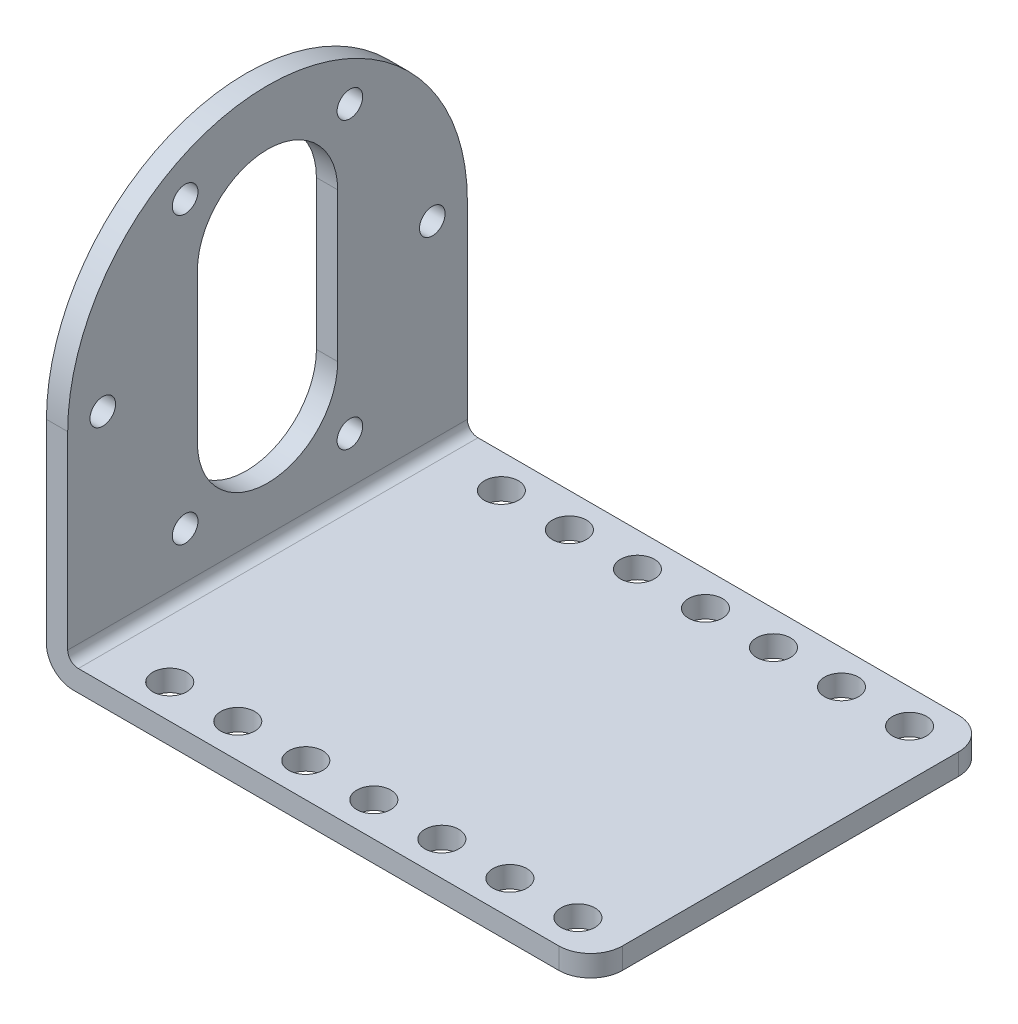
ISO-10303-21;
HEADER;
FILE_DESCRIPTION(('STEP AP214'),'2;1');
FILE_NAME('part.step','',(''),(''),'','','');
FILE_SCHEMA(('AUTOMOTIVE_DESIGN { 1 0 10303 214 1 1 1 1 }'));
ENDSEC;
DATA;
#1=APPLICATION_CONTEXT('core data for automotive mechanical design processes');
#2=APPLICATION_PROTOCOL_DEFINITION('international standard','automotive_design',2000,#1);
#3=PRODUCT_CONTEXT('',#1,'mechanical');
#4=PRODUCT('Part','Part','',(#3));
#5=PRODUCT_RELATED_PRODUCT_CATEGORY('part','',(#4));
#6=PRODUCT_DEFINITION_FORMATION('','',#4);
#7=PRODUCT_DEFINITION_CONTEXT('part definition',#1,'design');
#8=PRODUCT_DEFINITION('design','',#6,#7);
#9=PRODUCT_DEFINITION_SHAPE('','',#8);
#10=(LENGTH_UNIT() NAMED_UNIT(*) SI_UNIT(.MILLI.,.METRE.));
#11=(NAMED_UNIT(*) PLANE_ANGLE_UNIT() SI_UNIT($,.RADIAN.));
#12=(NAMED_UNIT(*) SI_UNIT($,.STERADIAN.) SOLID_ANGLE_UNIT());
#13=UNCERTAINTY_MEASURE_WITH_UNIT(LENGTH_MEASURE(1.E-05),#10,'distance_accuracy_value','');
#14=(GEOMETRIC_REPRESENTATION_CONTEXT(3) GLOBAL_UNCERTAINTY_ASSIGNED_CONTEXT((#13)) GLOBAL_UNIT_ASSIGNED_CONTEXT((#10,
#11,#12)) REPRESENTATION_CONTEXT('',''));
#15=CARTESIAN_POINT('',(0.,0.,0.));
#16=DIRECTION('',(0.,0.,1.));
#17=DIRECTION('',(1.,0.,0.));
#18=AXIS2_PLACEMENT_3D('',#15,#16,#17);
#19=CARTESIAN_POINT('',(3.00000000000001,2.,18.8));
#20=DIRECTION('',(0.,-1.,0.));
#21=DIRECTION('',(0.,0.,-1.));
#22=AXIS2_PLACEMENT_3D('',#19,#20,#21);
#23=PLANE('',#22);
#24=CARTESIAN_POINT('',(21.2,2.,15.6));
#25=DIRECTION('',(0.,1.,0.));
#26=DIRECTION('',(0.,0.,1.));
#27=AXIS2_PLACEMENT_3D('',#24,#25,#26);
#28=CIRCLE('',#27,1.59999999999999);
#29=CARTESIAN_POINT('',(21.2,2.,17.2));
#30=VERTEX_POINT('',#29);
#31=EDGE_CURVE('E345',#30,#30,#28,.T.);
#32=ORIENTED_EDGE('',*,*,#31,.F.);
#33=EDGE_LOOP('',(#32));
#34=FACE_BOUND('',#33,.T.);
#35=CARTESIAN_POINT('',(27.6,2.,15.6));
#36=DIRECTION('',(0.,1.,0.));
#37=DIRECTION('',(0.,0.,1.));
#38=AXIS2_PLACEMENT_3D('',#35,#36,#37);
#39=CIRCLE('',#38,1.59999999999999);
#40=CARTESIAN_POINT('',(27.6,2.,17.2));
#41=VERTEX_POINT('',#40);
#42=EDGE_CURVE('E333',#41,#41,#39,.T.);
#43=ORIENTED_EDGE('',*,*,#42,.F.);
#44=EDGE_LOOP('',(#43));
#45=FACE_BOUND('',#44,.T.);
#46=DIRECTION('',(0.,0.,-1.));
#47=VECTOR('',#46,1.);
#48=CARTESIAN_POINT('',(51.2,2.,18.8));
#49=LINE('',#48,#47);
#50=CARTESIAN_POINT('',(51.2,2.,15.8));
#51=VERTEX_POINT('',#50);
#52=CARTESIAN_POINT('',(51.2,2.,-15.8));
#53=VERTEX_POINT('',#52);
#54=EDGE_CURVE('E180',#51,#53,#49,.T.);
#55=ORIENTED_EDGE('',*,*,#54,.T.);
#56=CARTESIAN_POINT('',(48.2,2.,-15.8));
#57=DIRECTION('',(0.,-1.,0.));
#58=DIRECTION('',(0.,0.,-1.));
#59=AXIS2_PLACEMENT_3D('',#56,#57,#58);
#60=CIRCLE('',#59,3.);
#61=CARTESIAN_POINT('',(48.2,2.,-18.8));
#62=VERTEX_POINT('',#61);
#63=EDGE_CURVE('E196',#53,#62,#60,.F.);
#64=ORIENTED_EDGE('',*,*,#63,.T.);
#65=DIRECTION('',(-1.,0.,0.));
#66=VECTOR('',#65,1.);
#67=CARTESIAN_POINT('',(3.00000000000001,2.,-18.8));
#68=LINE('',#67,#66);
#69=CARTESIAN_POINT('',(3.00000000000001,2.,-18.8));
#70=VERTEX_POINT('',#69);
#71=EDGE_CURVE('E168',#62,#70,#68,.T.);
#72=ORIENTED_EDGE('',*,*,#71,.T.);
#73=DIRECTION('',(0.,0.,-1.));
#74=VECTOR('',#73,1.);
#75=CARTESIAN_POINT('',(3.00000000000001,2.,18.8));
#76=LINE('',#75,#74);
#77=CARTESIAN_POINT('',(3.00000000000001,2.,18.8));
#78=VERTEX_POINT('',#77);
#79=EDGE_CURVE('E177',#78,#70,#76,.T.);
#80=ORIENTED_EDGE('',*,*,#79,.F.);
#81=DIRECTION('',(-1.,0.,0.));
#82=VECTOR('',#81,1.);
#83=CARTESIAN_POINT('',(3.00000000000001,2.,18.8));
#84=LINE('',#83,#82);
#85=CARTESIAN_POINT('',(48.2,2.,18.8));
#86=VERTEX_POINT('',#85);
#87=EDGE_CURVE('E222',#86,#78,#84,.T.);
#88=ORIENTED_EDGE('',*,*,#87,.F.);
#89=CARTESIAN_POINT('',(48.2,2.,15.8));
#90=DIRECTION('',(0.,-1.,0.));
#91=DIRECTION('',(0.,0.,-1.));
#92=AXIS2_PLACEMENT_3D('',#89,#90,#91);
#93=CIRCLE('',#92,3.);
#94=EDGE_CURVE('E194',#86,#51,#93,.F.);
#95=ORIENTED_EDGE('',*,*,#94,.T.);
#96=EDGE_LOOP('',(#55,#64,#72,#80,#88,#95));
#97=FACE_BOUND('',#96,.T.);
#98=CARTESIAN_POINT('',(46.8,2.,15.6));
#99=DIRECTION('',(0.,1.,0.));
#100=DIRECTION('',(0.,0.,1.));
#101=AXIS2_PLACEMENT_3D('',#98,#99,#100);
#102=CIRCLE('',#101,1.59999999999999);
#103=CARTESIAN_POINT('',(46.8,2.,17.2));
#104=VERTEX_POINT('',#103);
#105=EDGE_CURVE('E297',#104,#104,#102,.T.);
#106=ORIENTED_EDGE('',*,*,#105,.F.);
#107=EDGE_LOOP('',(#106));
#108=FACE_BOUND('',#107,.T.);
#109=CARTESIAN_POINT('',(46.8,2.,-15.6));
#110=DIRECTION('',(0.,1.,0.));
#111=DIRECTION('',(0.,0.,1.));
#112=AXIS2_PLACEMENT_3D('',#109,#110,#111);
#113=CIRCLE('',#112,1.59999999999999);
#114=CARTESIAN_POINT('',(46.8,2.,-14.));
#115=VERTEX_POINT('',#114);
#116=EDGE_CURVE('E303',#115,#115,#113,.T.);
#117=ORIENTED_EDGE('',*,*,#116,.F.);
#118=EDGE_LOOP('',(#117));
#119=FACE_BOUND('',#118,.T.);
#120=CARTESIAN_POINT('',(40.4,2.,15.6));
#121=DIRECTION('',(0.,1.,0.));
#122=DIRECTION('',(0.,0.,1.));
#123=AXIS2_PLACEMENT_3D('',#120,#121,#122);
#124=CIRCLE('',#123,1.59999999999999);
#125=CARTESIAN_POINT('',(40.4,2.,17.2));
#126=VERTEX_POINT('',#125);
#127=EDGE_CURVE('E309',#126,#126,#124,.T.);
#128=ORIENTED_EDGE('',*,*,#127,.F.);
#129=EDGE_LOOP('',(#128));
#130=FACE_BOUND('',#129,.T.);
#131=CARTESIAN_POINT('',(40.4,2.,-15.6));
#132=DIRECTION('',(0.,1.,0.));
#133=DIRECTION('',(0.,0.,1.));
#134=AXIS2_PLACEMENT_3D('',#131,#132,#133);
#135=CIRCLE('',#134,1.59999999999999);
#136=CARTESIAN_POINT('',(40.4,2.,-14.));
#137=VERTEX_POINT('',#136);
#138=EDGE_CURVE('E315',#137,#137,#135,.T.);
#139=ORIENTED_EDGE('',*,*,#138,.F.);
#140=EDGE_LOOP('',(#139));
#141=FACE_BOUND('',#140,.T.);
#142=CARTESIAN_POINT('',(34.,2.,15.6));
#143=DIRECTION('',(0.,1.,0.));
#144=DIRECTION('',(0.,0.,1.));
#145=AXIS2_PLACEMENT_3D('',#142,#143,#144);
#146=CIRCLE('',#145,1.59999999999999);
#147=CARTESIAN_POINT('',(34.,2.,17.2));
#148=VERTEX_POINT('',#147);
#149=EDGE_CURVE('E321',#148,#148,#146,.T.);
#150=ORIENTED_EDGE('',*,*,#149,.F.);
#151=EDGE_LOOP('',(#150));
#152=FACE_BOUND('',#151,.T.);
#153=CARTESIAN_POINT('',(34.,2.,-15.6));
#154=DIRECTION('',(0.,1.,0.));
#155=DIRECTION('',(0.,0.,1.));
#156=AXIS2_PLACEMENT_3D('',#153,#154,#155);
#157=CIRCLE('',#156,1.59999999999999);
#158=CARTESIAN_POINT('',(34.,2.,-14.));
#159=VERTEX_POINT('',#158);
#160=EDGE_CURVE('E327',#159,#159,#157,.T.);
#161=ORIENTED_EDGE('',*,*,#160,.F.);
#162=EDGE_LOOP('',(#161));
#163=FACE_BOUND('',#162,.T.);
#164=CARTESIAN_POINT('',(27.6,2.,-15.6));
#165=DIRECTION('',(0.,1.,0.));
#166=DIRECTION('',(0.,0.,1.));
#167=AXIS2_PLACEMENT_3D('',#164,#165,#166);
#168=CIRCLE('',#167,1.59999999999999);
#169=CARTESIAN_POINT('',(27.6,2.,-14.));
#170=VERTEX_POINT('',#169);
#171=EDGE_CURVE('E339',#170,#170,#168,.T.);
#172=ORIENTED_EDGE('',*,*,#171,.F.);
#173=EDGE_LOOP('',(#172));
#174=FACE_BOUND('',#173,.T.);
#175=CARTESIAN_POINT('',(21.2,2.,-15.6));
#176=DIRECTION('',(0.,1.,0.));
#177=DIRECTION('',(0.,0.,1.));
#178=AXIS2_PLACEMENT_3D('',#175,#176,#177);
#179=CIRCLE('',#178,1.59999999999999);
#180=CARTESIAN_POINT('',(21.2,2.,-14.));
#181=VERTEX_POINT('',#180);
#182=EDGE_CURVE('E351',#181,#181,#179,.T.);
#183=ORIENTED_EDGE('',*,*,#182,.F.);
#184=EDGE_LOOP('',(#183));
#185=FACE_BOUND('',#184,.T.);
#186=CARTESIAN_POINT('',(14.8,2.,15.6));
#187=DIRECTION('',(0.,1.,0.));
#188=DIRECTION('',(0.,0.,1.));
#189=AXIS2_PLACEMENT_3D('',#186,#187,#188);
#190=CIRCLE('',#189,1.59999999999999);
#191=CARTESIAN_POINT('',(14.8,2.,17.2));
#192=VERTEX_POINT('',#191);
#193=EDGE_CURVE('E357',#192,#192,#190,.T.);
#194=ORIENTED_EDGE('',*,*,#193,.F.);
#195=EDGE_LOOP('',(#194));
#196=FACE_BOUND('',#195,.T.);
#197=CARTESIAN_POINT('',(14.8,2.,-15.6));
#198=DIRECTION('',(0.,1.,0.));
#199=DIRECTION('',(0.,0.,1.));
#200=AXIS2_PLACEMENT_3D('',#197,#198,#199);
#201=CIRCLE('',#200,1.59999999999999);
#202=CARTESIAN_POINT('',(14.8,2.,-14.));
#203=VERTEX_POINT('',#202);
#204=EDGE_CURVE('E363',#203,#203,#201,.T.);
#205=ORIENTED_EDGE('',*,*,#204,.F.);
#206=EDGE_LOOP('',(#205));
#207=FACE_BOUND('',#206,.T.);
#208=CARTESIAN_POINT('',(8.4,2.,15.6));
#209=DIRECTION('',(0.,1.,0.));
#210=DIRECTION('',(0.,0.,1.));
#211=AXIS2_PLACEMENT_3D('',#208,#209,#210);
#212=CIRCLE('',#211,1.59999999999999);
#213=CARTESIAN_POINT('',(8.4,2.,17.2));
#214=VERTEX_POINT('',#213);
#215=EDGE_CURVE('E369',#214,#214,#212,.T.);
#216=ORIENTED_EDGE('',*,*,#215,.F.);
#217=EDGE_LOOP('',(#216));
#218=FACE_BOUND('',#217,.T.);
#219=CARTESIAN_POINT('',(8.4,2.,-15.6));
#220=DIRECTION('',(0.,1.,0.));
#221=DIRECTION('',(0.,0.,1.));
#222=AXIS2_PLACEMENT_3D('',#219,#220,#221);
#223=CIRCLE('',#222,1.59999999999999);
#224=CARTESIAN_POINT('',(8.4,2.,-14.));
#225=VERTEX_POINT('',#224);
#226=EDGE_CURVE('E375',#225,#225,#223,.T.);
#227=ORIENTED_EDGE('',*,*,#226,.F.);
#228=EDGE_LOOP('',(#227));
#229=FACE_BOUND('',#228,.T.);
#230=ADVANCED_FACE('F34',(#34,#45,#97,#108,#119,#130,#141,#152,#163,#174,#185,#196,#207,#218,
#229),#23,.F.);
#231=CARTESIAN_POINT('',(2.5,2.5,-18.8));
#232=DIRECTION('',(0.,0.,-1.));
#233=DIRECTION('',(-1.,0.,0.));
#234=AXIS2_PLACEMENT_3D('',#231,#232,#233);
#235=PLANE('',#234);
#236=ORIENTED_EDGE('',*,*,#71,.F.);
#237=DIRECTION('',(0.,1.,0.));
#238=VECTOR('',#237,1.);
#239=CARTESIAN_POINT('',(48.2,0.,-18.8));
#240=LINE('',#239,#238);
#241=CARTESIAN_POINT('',(48.2,0.,-18.8));
#242=VERTEX_POINT('',#241);
#243=EDGE_CURVE('E57',#62,#242,#240,.F.);
#244=ORIENTED_EDGE('',*,*,#243,.T.);
#245=DIRECTION('',(1.,0.,0.));
#246=VECTOR('',#245,1.);
#247=CARTESIAN_POINT('',(2.50000000000002,0.,-18.8));
#248=LINE('',#247,#246);
#249=CARTESIAN_POINT('',(2.50000000000002,0.,-18.8));
#250=VERTEX_POINT('',#249);
#251=EDGE_CURVE('E201',#250,#242,#248,.T.);
#252=ORIENTED_EDGE('',*,*,#251,.F.);
#253=CARTESIAN_POINT('',(2.5,2.5,-18.8));
#254=DIRECTION('',(0.,0.,1.));
#255=DIRECTION('',(-1.,0.,0.));
#256=AXIS2_PLACEMENT_3D('',#253,#254,#255);
#257=CIRCLE('',#256,2.5);
#258=CARTESIAN_POINT('',(0.,2.50000000000002,-18.8));
#259=VERTEX_POINT('',#258);
#260=EDGE_CURVE('E212',#259,#250,#257,.T.);
#261=ORIENTED_EDGE('',*,*,#260,.F.);
#262=DIRECTION('',(0.,-1.,0.));
#263=VECTOR('',#262,1.);
#264=CARTESIAN_POINT('',(0.,2.50000000000002,-18.8));
#265=LINE('',#264,#263);
#266=CARTESIAN_POINT('',(0.,20.8,-18.8));
#267=VERTEX_POINT('',#266);
#268=EDGE_CURVE('E156',#267,#259,#265,.T.);
#269=ORIENTED_EDGE('',*,*,#268,.F.);
#270=DIRECTION('',(-1.,0.,0.));
#271=VECTOR('',#270,1.);
#272=CARTESIAN_POINT('',(51.201,20.8,-18.8));
#273=LINE('',#272,#271);
#274=CARTESIAN_POINT('',(1.99999999999999,20.8,-18.8));
#275=VERTEX_POINT('',#274);
#276=EDGE_CURVE('E140',#275,#267,#273,.T.);
#277=ORIENTED_EDGE('',*,*,#276,.F.);
#278=DIRECTION('',(0.,1.,0.));
#279=VECTOR('',#278,1.);
#280=CARTESIAN_POINT('',(2.,3.00000000000001,-18.8));
#281=LINE('',#280,#279);
#282=CARTESIAN_POINT('',(2.,3.,-18.8));
#283=VERTEX_POINT('',#282);
#284=EDGE_CURVE('E154',#283,#275,#281,.T.);
#285=ORIENTED_EDGE('',*,*,#284,.F.);
#286=CARTESIAN_POINT('',(3.,3.,-18.8));
#287=DIRECTION('',(0.,0.,-1.));
#288=DIRECTION('',(-1.,0.,0.));
#289=AXIS2_PLACEMENT_3D('',#286,#287,#288);
#290=CIRCLE('',#289,1.);
#291=EDGE_CURVE('E164',#70,#283,#290,.T.);
#292=ORIENTED_EDGE('',*,*,#291,.F.);
#293=EDGE_LOOP('',(#236,#244,#252,#261,#269,#277,#285,#292));
#294=FACE_BOUND('',#293,.T.);
#295=ADVANCED_FACE('F152',(#294),#235,.T.);
#296=CARTESIAN_POINT('',(2.,3.00000000000001,18.8));
#297=DIRECTION('',(-1.,0.,0.));
#298=DIRECTION('',(0.,-1.,0.));
#299=AXIS2_PLACEMENT_3D('',#296,#297,#298);
#300=PLANE('',#299);
#301=CARTESIAN_POINT('',(2.,20.8,-15.5));
#302=DIRECTION('',(-1.,0.,0.));
#303=DIRECTION('',(0.,-1.,0.));
#304=AXIS2_PLACEMENT_3D('',#301,#302,#303);
#305=CIRCLE('',#304,1.20435455150252);
#306=CARTESIAN_POINT('',(2.,19.5956454484975,-15.5));
#307=VERTEX_POINT('',#306);
#308=EDGE_CURVE('E274',#307,#307,#305,.F.);
#309=ORIENTED_EDGE('',*,*,#308,.F.);
#310=EDGE_LOOP('',(#309));
#311=FACE_BOUND('',#310,.T.);
#312=CARTESIAN_POINT('',(1.99999999999999,34.2233937586588,-7.75));
#313=DIRECTION('',(-1.,0.,0.));
#314=DIRECTION('',(0.,-1.,0.));
#315=AXIS2_PLACEMENT_3D('',#312,#313,#314);
#316=CIRCLE('',#315,1.20435455150252);
#317=CARTESIAN_POINT('',(1.99999999999999,33.0190392071563,-7.75));
#318=VERTEX_POINT('',#317);
#319=EDGE_CURVE('E279',#318,#318,#316,.F.);
#320=ORIENTED_EDGE('',*,*,#319,.F.);
#321=EDGE_LOOP('',(#320));
#322=FACE_BOUND('',#321,.T.);
#323=CARTESIAN_POINT('',(1.99999999999999,34.2233937586588,7.75));
#324=DIRECTION('',(-1.,0.,0.));
#325=DIRECTION('',(0.,-1.,0.));
#326=AXIS2_PLACEMENT_3D('',#323,#324,#325);
#327=CIRCLE('',#326,1.20435455150252);
#328=CARTESIAN_POINT('',(1.99999999999999,33.0190392071563,7.75));
#329=VERTEX_POINT('',#328);
#330=EDGE_CURVE('E286',#329,#329,#327,.F.);
#331=ORIENTED_EDGE('',*,*,#330,.F.);
#332=EDGE_LOOP('',(#331));
#333=FACE_BOUND('',#332,.T.);
#334=DIRECTION('',(0.,-1.,0.));
#335=VECTOR('',#334,1.);
#336=CARTESIAN_POINT('',(1.99999999999999,27.8,6.6));
#337=LINE('',#336,#335);
#338=CARTESIAN_POINT('',(1.99999999999999,27.8,6.6));
#339=VERTEX_POINT('',#338);
#340=CARTESIAN_POINT('',(2.,13.8,6.6));
#341=VERTEX_POINT('',#340);
#342=EDGE_CURVE('E263',#339,#341,#337,.T.);
#343=ORIENTED_EDGE('',*,*,#342,.F.);
#344=CARTESIAN_POINT('',(1.99999999999999,27.8,0.));
#345=DIRECTION('',(-1.,0.,0.));
#346=DIRECTION('',(0.,-1.,0.));
#347=AXIS2_PLACEMENT_3D('',#344,#345,#346);
#348=CIRCLE('',#347,6.6);
#349=CARTESIAN_POINT('',(1.99999999999999,27.8,-6.6));
#350=VERTEX_POINT('',#349);
#351=EDGE_CURVE('E260',#350,#339,#348,.F.);
#352=ORIENTED_EDGE('',*,*,#351,.F.);
#353=DIRECTION('',(0.,1.,0.));
#354=VECTOR('',#353,1.);
#355=CARTESIAN_POINT('',(1.99999999999999,27.8,-6.6));
#356=LINE('',#355,#354);
#357=CARTESIAN_POINT('',(2.,13.8,-6.6));
#358=VERTEX_POINT('',#357);
#359=EDGE_CURVE('E149',#358,#350,#356,.T.);
#360=ORIENTED_EDGE('',*,*,#359,.F.);
#361=CARTESIAN_POINT('',(2.,13.8,0.));
#362=DIRECTION('',(-1.,0.,0.));
#363=DIRECTION('',(0.,-1.,0.));
#364=AXIS2_PLACEMENT_3D('',#361,#362,#363);
#365=CIRCLE('',#364,6.6);
#366=EDGE_CURVE('E233',#341,#358,#365,.F.);
#367=ORIENTED_EDGE('',*,*,#366,.F.);
#368=EDGE_LOOP('',(#343,#352,#360,#367));
#369=FACE_BOUND('',#368,.T.);
#370=CARTESIAN_POINT('',(2.,20.8,15.5));
#371=DIRECTION('',(-1.,0.,0.));
#372=DIRECTION('',(0.,-1.,0.));
#373=AXIS2_PLACEMENT_3D('',#370,#371,#372);
#374=CIRCLE('',#373,1.20435455150252);
#375=CARTESIAN_POINT('',(2.,19.5956454484975,15.5));
#376=VERTEX_POINT('',#375);
#377=EDGE_CURVE('E230',#376,#376,#374,.F.);
#378=ORIENTED_EDGE('',*,*,#377,.F.);
#379=EDGE_LOOP('',(#378));
#380=FACE_BOUND('',#379,.T.);
#381=CARTESIAN_POINT('',(2.,7.3766062413412,7.75));
#382=DIRECTION('',(-1.,0.,0.));
#383=DIRECTION('',(0.,-1.,0.));
#384=AXIS2_PLACEMENT_3D('',#381,#382,#383);
#385=CIRCLE('',#384,1.20435455150252);
#386=CARTESIAN_POINT('',(2.,6.17225168983868,7.75));
#387=VERTEX_POINT('',#386);
#388=EDGE_CURVE('E237',#387,#387,#385,.F.);
#389=ORIENTED_EDGE('',*,*,#388,.F.);
#390=EDGE_LOOP('',(#389));
#391=FACE_BOUND('',#390,.T.);
#392=CARTESIAN_POINT('',(2.,7.3766062413412,-7.75));
#393=DIRECTION('',(-1.,0.,0.));
#394=DIRECTION('',(0.,-1.,0.));
#395=AXIS2_PLACEMENT_3D('',#392,#393,#394);
#396=CIRCLE('',#395,1.20435455150252);
#397=CARTESIAN_POINT('',(2.,6.17225168983868,-7.75));
#398=VERTEX_POINT('',#397);
#399=EDGE_CURVE('E267',#398,#398,#396,.F.);
#400=ORIENTED_EDGE('',*,*,#399,.F.);
#401=EDGE_LOOP('',(#400));
#402=FACE_BOUND('',#401,.T.);
#403=ORIENTED_EDGE('',*,*,#284,.T.);
#404=CARTESIAN_POINT('',(2.,20.8,0.));
#405=DIRECTION('',(-1.,0.,0.));
#406=DIRECTION('',(0.,-1.,0.));
#407=AXIS2_PLACEMENT_3D('',#404,#405,#406);
#408=CIRCLE('',#407,18.8);
#409=CARTESIAN_POINT('',(2.,20.8,18.8));
#410=VERTEX_POINT('',#409);
#411=EDGE_CURVE('E137',#410,#275,#408,.T.);
#412=ORIENTED_EDGE('',*,*,#411,.F.);
#413=DIRECTION('',(0.,1.,0.));
#414=VECTOR('',#413,1.);
#415=CARTESIAN_POINT('',(2.,3.00000000000001,18.8));
#416=LINE('',#415,#414);
#417=CARTESIAN_POINT('',(2.,3.,18.8));
#418=VERTEX_POINT('',#417);
#419=EDGE_CURVE('E218',#418,#410,#416,.T.);
#420=ORIENTED_EDGE('',*,*,#419,.F.);
#421=DIRECTION('',(0.,0.,-1.));
#422=VECTOR('',#421,1.);
#423=CARTESIAN_POINT('',(2.,3.,18.8));
#424=LINE('',#423,#422);
#425=EDGE_CURVE('E163',#418,#283,#424,.T.);
#426=ORIENTED_EDGE('',*,*,#425,.T.);
#427=EDGE_LOOP('',(#403,#412,#420,#426));
#428=FACE_BOUND('',#427,.T.);
#429=ADVANCED_FACE('F161',(#311,#322,#333,#369,#380,#391,#402,#428),#300,.F.);
#430=CARTESIAN_POINT('',(0.,2.50000000000002,18.8));
#431=DIRECTION('',(1.,0.,0.));
#432=DIRECTION('',(0.,0.,-1.));
#433=AXIS2_PLACEMENT_3D('',#430,#431,#432);
#434=PLANE('',#433);
#435=CARTESIAN_POINT('',(0.,20.8,-15.5));
#436=DIRECTION('',(-1.,0.,0.));
#437=DIRECTION('',(0.,0.,1.));
#438=AXIS2_PLACEMENT_3D('',#435,#436,#437);
#439=CIRCLE('',#438,1.20435455150252);
#440=CARTESIAN_POINT('',(0.,20.8,-14.2956454484975));
#441=VERTEX_POINT('',#440);
#442=EDGE_CURVE('E282',#441,#441,#439,.T.);
#443=ORIENTED_EDGE('',*,*,#442,.F.);
#444=EDGE_LOOP('',(#443));
#445=FACE_BOUND('',#444,.T.);
#446=CARTESIAN_POINT('',(0.,34.2233937586588,-7.75));
#447=DIRECTION('',(-1.,0.,0.));
#448=DIRECTION('',(0.,0.,1.));
#449=AXIS2_PLACEMENT_3D('',#446,#447,#448);
#450=CIRCLE('',#449,1.20435455150252);
#451=CARTESIAN_POINT('',(0.,34.2233937586588,-6.54564544849748));
#452=VERTEX_POINT('',#451);
#453=EDGE_CURVE('E283',#452,#452,#450,.T.);
#454=ORIENTED_EDGE('',*,*,#453,.F.);
#455=EDGE_LOOP('',(#454));
#456=FACE_BOUND('',#455,.T.);
#457=CARTESIAN_POINT('',(0.,34.2233937586588,7.75));
#458=DIRECTION('',(-1.,0.,0.));
#459=DIRECTION('',(0.,0.,1.));
#460=AXIS2_PLACEMENT_3D('',#457,#458,#459);
#461=CIRCLE('',#460,1.20435455150252);
#462=CARTESIAN_POINT('',(0.,34.2233937586588,8.95435455150252));
#463=VERTEX_POINT('',#462);
#464=EDGE_CURVE('E157',#463,#463,#461,.T.);
#465=ORIENTED_EDGE('',*,*,#464,.F.);
#466=EDGE_LOOP('',(#465));
#467=FACE_BOUND('',#466,.T.);
#468=DIRECTION('',(0.,-1.,0.));
#469=VECTOR('',#468,1.);
#470=CARTESIAN_POINT('',(0.,27.8,-6.6));
#471=LINE('',#470,#469);
#472=CARTESIAN_POINT('',(0.,27.8,-6.60000000000001));
#473=VERTEX_POINT('',#472);
#474=CARTESIAN_POINT('',(0.,13.8,-6.6));
#475=VERTEX_POINT('',#474);
#476=EDGE_CURVE('E255',#473,#475,#471,.T.);
#477=ORIENTED_EDGE('',*,*,#476,.F.);
#478=CARTESIAN_POINT('',(0.,27.8,0.));
#479=DIRECTION('',(-1.,0.,0.));
#480=DIRECTION('',(0.,0.,1.));
#481=AXIS2_PLACEMENT_3D('',#478,#479,#480);
#482=CIRCLE('',#481,6.6);
#483=CARTESIAN_POINT('',(0.,27.8,6.6));
#484=VERTEX_POINT('',#483);
#485=EDGE_CURVE('E258',#484,#473,#482,.T.);
#486=ORIENTED_EDGE('',*,*,#485,.F.);
#487=DIRECTION('',(0.,1.,0.));
#488=VECTOR('',#487,1.);
#489=CARTESIAN_POINT('',(0.,27.8,6.6));
#490=LINE('',#489,#488);
#491=CARTESIAN_POINT('',(0.,13.8,6.6));
#492=VERTEX_POINT('',#491);
#493=EDGE_CURVE('E245',#492,#484,#490,.T.);
#494=ORIENTED_EDGE('',*,*,#493,.F.);
#495=CARTESIAN_POINT('',(0.,13.8,0.));
#496=DIRECTION('',(-1.,0.,0.));
#497=DIRECTION('',(0.,0.,1.));
#498=AXIS2_PLACEMENT_3D('',#495,#496,#497);
#499=CIRCLE('',#498,6.6);
#500=EDGE_CURVE('E252',#475,#492,#499,.T.);
#501=ORIENTED_EDGE('',*,*,#500,.F.);
#502=EDGE_LOOP('',(#477,#486,#494,#501));
#503=FACE_BOUND('',#502,.T.);
#504=CARTESIAN_POINT('',(0.,20.8,15.5));
#505=DIRECTION('',(-1.,0.,0.));
#506=DIRECTION('',(0.,0.,1.));
#507=AXIS2_PLACEMENT_3D('',#504,#505,#506);
#508=CIRCLE('',#507,1.20435455150252);
#509=CARTESIAN_POINT('',(0.,20.8,16.7043545515025));
#510=VERTEX_POINT('',#509);
#511=EDGE_CURVE('E234',#510,#510,#508,.T.);
#512=ORIENTED_EDGE('',*,*,#511,.F.);
#513=EDGE_LOOP('',(#512));
#514=FACE_BOUND('',#513,.T.);
#515=CARTESIAN_POINT('',(0.,7.3766062413412,7.75));
#516=DIRECTION('',(-1.,0.,0.));
#517=DIRECTION('',(0.,0.,1.));
#518=AXIS2_PLACEMENT_3D('',#515,#516,#517);
#519=CIRCLE('',#518,1.20435455150252);
#520=CARTESIAN_POINT('',(0.,7.3766062413412,8.95435455150252));
#521=VERTEX_POINT('',#520);
#522=EDGE_CURVE('E270',#521,#521,#519,.T.);
#523=ORIENTED_EDGE('',*,*,#522,.F.);
#524=EDGE_LOOP('',(#523));
#525=FACE_BOUND('',#524,.T.);
#526=CARTESIAN_POINT('',(0.,7.3766062413412,-7.75));
#527=DIRECTION('',(-1.,0.,0.));
#528=DIRECTION('',(0.,0.,1.));
#529=AXIS2_PLACEMENT_3D('',#526,#527,#528);
#530=CIRCLE('',#529,1.20435455150252);
#531=CARTESIAN_POINT('',(0.,7.3766062413412,-6.54564544849748));
#532=VERTEX_POINT('',#531);
#533=EDGE_CURVE('E271',#532,#532,#530,.T.);
#534=ORIENTED_EDGE('',*,*,#533,.F.);
#535=EDGE_LOOP('',(#534));
#536=FACE_BOUND('',#535,.T.);
#537=CARTESIAN_POINT('',(0.,20.8,0.));
#538=DIRECTION('',(1.,0.,0.));
#539=DIRECTION('',(0.,0.,1.));
#540=AXIS2_PLACEMENT_3D('',#537,#538,#539);
#541=CIRCLE('',#540,18.8);
#542=CARTESIAN_POINT('',(0.,20.8,18.8));
#543=VERTEX_POINT('',#542);
#544=EDGE_CURVE('E148',#267,#543,#541,.T.);
#545=ORIENTED_EDGE('',*,*,#544,.F.);
#546=ORIENTED_EDGE('',*,*,#268,.T.);
#547=DIRECTION('',(0.,0.,-1.));
#548=VECTOR('',#547,1.);
#549=CARTESIAN_POINT('',(0.,2.50000000000002,18.8));
#550=LINE('',#549,#548);
#551=CARTESIAN_POINT('',(0.,2.50000000000002,18.8));
#552=VERTEX_POINT('',#551);
#553=EDGE_CURVE('E172',#552,#259,#550,.T.);
#554=ORIENTED_EDGE('',*,*,#553,.F.);
#555=DIRECTION('',(0.,-1.,0.));
#556=VECTOR('',#555,1.);
#557=CARTESIAN_POINT('',(0.,2.50000000000002,18.8));
#558=LINE('',#557,#556);
#559=EDGE_CURVE('E175',#543,#552,#558,.T.);
#560=ORIENTED_EDGE('',*,*,#559,.F.);
#561=EDGE_LOOP('',(#545,#546,#554,#560));
#562=FACE_BOUND('',#561,.T.);
#563=ADVANCED_FACE('F455',(#445,#456,#467,#503,#514,#525,#536,#562),#434,.F.);
#564=CARTESIAN_POINT('',(2.5,2.5,18.8));
#565=DIRECTION('',(0.,0.,-1.));
#566=DIRECTION('',(-1.,0.,0.));
#567=AXIS2_PLACEMENT_3D('',#564,#565,#566);
#568=PLANE('',#567);
#569=DIRECTION('',(1.,0.,0.));
#570=VECTOR('',#569,1.);
#571=CARTESIAN_POINT('',(2.50000000000002,0.,18.8));
#572=LINE('',#571,#570);
#573=CARTESIAN_POINT('',(2.50000000000002,0.,18.8));
#574=VERTEX_POINT('',#573);
#575=CARTESIAN_POINT('',(48.2,0.,18.8));
#576=VERTEX_POINT('',#575);
#577=EDGE_CURVE('E224',#574,#576,#572,.T.);
#578=ORIENTED_EDGE('',*,*,#577,.T.);
#579=DIRECTION('',(0.,1.,0.));
#580=VECTOR('',#579,1.);
#581=CARTESIAN_POINT('',(48.2,2.5,18.8));
#582=LINE('',#581,#580);
#583=EDGE_CURVE('E11',#576,#86,#582,.T.);
#584=ORIENTED_EDGE('',*,*,#583,.T.);
#585=ORIENTED_EDGE('',*,*,#87,.T.);
#586=CARTESIAN_POINT('',(3.,3.,18.8));
#587=DIRECTION('',(0.,0.,-1.));
#588=DIRECTION('',(-1.,0.,0.));
#589=AXIS2_PLACEMENT_3D('',#586,#587,#588);
#590=CIRCLE('',#589,1.);
#591=EDGE_CURVE('E220',#78,#418,#590,.T.);
#592=ORIENTED_EDGE('',*,*,#591,.T.);
#593=ORIENTED_EDGE('',*,*,#419,.T.);
#594=DIRECTION('',(-1.,0.,0.));
#595=VECTOR('',#594,1.);
#596=CARTESIAN_POINT('',(51.201,20.8,18.8));
#597=LINE('',#596,#595);
#598=EDGE_CURVE('E143',#410,#543,#597,.T.);
#599=ORIENTED_EDGE('',*,*,#598,.T.);
#600=ORIENTED_EDGE('',*,*,#559,.T.);
#601=CARTESIAN_POINT('',(2.5,2.5,18.8));
#602=DIRECTION('',(0.,0.,1.));
#603=DIRECTION('',(-1.,0.,0.));
#604=AXIS2_PLACEMENT_3D('',#601,#602,#603);
#605=CIRCLE('',#604,2.5);
#606=EDGE_CURVE('E166',#552,#574,#605,.T.);
#607=ORIENTED_EDGE('',*,*,#606,.T.);
#608=EDGE_LOOP('',(#578,#584,#585,#592,#593,#599,#600,#607));
#609=FACE_BOUND('',#608,.T.);
#610=ADVANCED_FACE('F401',(#609),#568,.F.);
#611=CARTESIAN_POINT('',(2.5,2.5,18.8));
#612=DIRECTION('',(0.,0.,-1.));
#613=DIRECTION('',(-1.,0.,0.));
#614=AXIS2_PLACEMENT_3D('',#611,#612,#613);
#615=CYLINDRICAL_SURFACE('',#614,2.5);
#616=ORIENTED_EDGE('',*,*,#260,.T.);
#617=DIRECTION('',(0.,0.,-1.));
#618=VECTOR('',#617,1.);
#619=CARTESIAN_POINT('',(2.50000000000002,0.,18.8));
#620=LINE('',#619,#618);
#621=EDGE_CURVE('E186',#574,#250,#620,.T.);
#622=ORIENTED_EDGE('',*,*,#621,.F.);
#623=ORIENTED_EDGE('',*,*,#606,.F.);
#624=ORIENTED_EDGE('',*,*,#553,.T.);
#625=EDGE_LOOP('',(#616,#622,#623,#624));
#626=FACE_BOUND('',#625,.T.);
#627=ADVANCED_FACE('F398',(#626),#615,.T.);
#628=CARTESIAN_POINT('',(2.50000000000002,0.,18.8));
#629=DIRECTION('',(0.,1.,0.));
#630=DIRECTION('',(0.,0.,1.));
#631=AXIS2_PLACEMENT_3D('',#628,#629,#630);
#632=PLANE('',#631);
#633=CARTESIAN_POINT('',(8.4,0.,-15.6));
#634=DIRECTION('',(0.,1.,0.));
#635=DIRECTION('',(0.,0.,1.));
#636=AXIS2_PLACEMENT_3D('',#633,#634,#635);
#637=CIRCLE('',#636,1.59999999999999);
#638=CARTESIAN_POINT('',(8.4,0.,-14.));
#639=VERTEX_POINT('',#638);
#640=EDGE_CURVE('E372',#639,#639,#637,.T.);
#641=ORIENTED_EDGE('',*,*,#640,.T.);
#642=EDGE_LOOP('',(#641));
#643=FACE_BOUND('',#642,.T.);
#644=CARTESIAN_POINT('',(8.4,0.,15.6));
#645=DIRECTION('',(0.,1.,0.));
#646=DIRECTION('',(0.,0.,1.));
#647=AXIS2_PLACEMENT_3D('',#644,#645,#646);
#648=CIRCLE('',#647,1.59999999999999);
#649=CARTESIAN_POINT('',(8.4,0.,17.2));
#650=VERTEX_POINT('',#649);
#651=EDGE_CURVE('E366',#650,#650,#648,.T.);
#652=ORIENTED_EDGE('',*,*,#651,.T.);
#653=EDGE_LOOP('',(#652));
#654=FACE_BOUND('',#653,.T.);
#655=CARTESIAN_POINT('',(14.8,0.,-15.6));
#656=DIRECTION('',(0.,1.,0.));
#657=DIRECTION('',(0.,0.,1.));
#658=AXIS2_PLACEMENT_3D('',#655,#656,#657);
#659=CIRCLE('',#658,1.59999999999999);
#660=CARTESIAN_POINT('',(14.8,0.,-14.));
#661=VERTEX_POINT('',#660);
#662=EDGE_CURVE('E360',#661,#661,#659,.T.);
#663=ORIENTED_EDGE('',*,*,#662,.T.);
#664=EDGE_LOOP('',(#663));
#665=FACE_BOUND('',#664,.T.);
#666=CARTESIAN_POINT('',(14.8,0.,15.6));
#667=DIRECTION('',(0.,1.,0.));
#668=DIRECTION('',(0.,0.,1.));
#669=AXIS2_PLACEMENT_3D('',#666,#667,#668);
#670=CIRCLE('',#669,1.59999999999999);
#671=CARTESIAN_POINT('',(14.8,0.,17.2));
#672=VERTEX_POINT('',#671);
#673=EDGE_CURVE('E354',#672,#672,#670,.T.);
#674=ORIENTED_EDGE('',*,*,#673,.T.);
#675=EDGE_LOOP('',(#674));
#676=FACE_BOUND('',#675,.T.);
#677=CARTESIAN_POINT('',(21.2,0.,-15.6));
#678=DIRECTION('',(0.,1.,0.));
#679=DIRECTION('',(0.,0.,1.));
#680=AXIS2_PLACEMENT_3D('',#677,#678,#679);
#681=CIRCLE('',#680,1.59999999999999);
#682=CARTESIAN_POINT('',(21.2,0.,-14.));
#683=VERTEX_POINT('',#682);
#684=EDGE_CURVE('E348',#683,#683,#681,.T.);
#685=ORIENTED_EDGE('',*,*,#684,.T.);
#686=EDGE_LOOP('',(#685));
#687=FACE_BOUND('',#686,.T.);
#688=CARTESIAN_POINT('',(21.2,0.,15.6));
#689=DIRECTION('',(0.,1.,0.));
#690=DIRECTION('',(0.,0.,1.));
#691=AXIS2_PLACEMENT_3D('',#688,#689,#690);
#692=CIRCLE('',#691,1.59999999999999);
#693=CARTESIAN_POINT('',(21.2,0.,17.2));
#694=VERTEX_POINT('',#693);
#695=EDGE_CURVE('E342',#694,#694,#692,.T.);
#696=ORIENTED_EDGE('',*,*,#695,.T.);
#697=EDGE_LOOP('',(#696));
#698=FACE_BOUND('',#697,.T.);
#699=CARTESIAN_POINT('',(27.6,0.,-15.6));
#700=DIRECTION('',(0.,1.,0.));
#701=DIRECTION('',(0.,0.,1.));
#702=AXIS2_PLACEMENT_3D('',#699,#700,#701);
#703=CIRCLE('',#702,1.59999999999999);
#704=CARTESIAN_POINT('',(27.6,0.,-14.));
#705=VERTEX_POINT('',#704);
#706=EDGE_CURVE('E336',#705,#705,#703,.T.);
#707=ORIENTED_EDGE('',*,*,#706,.T.);
#708=EDGE_LOOP('',(#707));
#709=FACE_BOUND('',#708,.T.);
#710=CARTESIAN_POINT('',(27.6,0.,15.6));
#711=DIRECTION('',(0.,1.,0.));
#712=DIRECTION('',(0.,0.,1.));
#713=AXIS2_PLACEMENT_3D('',#710,#711,#712);
#714=CIRCLE('',#713,1.59999999999999);
#715=CARTESIAN_POINT('',(27.6,0.,17.2));
#716=VERTEX_POINT('',#715);
#717=EDGE_CURVE('E330',#716,#716,#714,.T.);
#718=ORIENTED_EDGE('',*,*,#717,.T.);
#719=EDGE_LOOP('',(#718));
#720=FACE_BOUND('',#719,.T.);
#721=CARTESIAN_POINT('',(34.,0.,-15.6));
#722=DIRECTION('',(0.,1.,0.));
#723=DIRECTION('',(0.,0.,1.));
#724=AXIS2_PLACEMENT_3D('',#721,#722,#723);
#725=CIRCLE('',#724,1.59999999999999);
#726=CARTESIAN_POINT('',(34.,0.,-14.));
#727=VERTEX_POINT('',#726);
#728=EDGE_CURVE('E324',#727,#727,#725,.T.);
#729=ORIENTED_EDGE('',*,*,#728,.T.);
#730=EDGE_LOOP('',(#729));
#731=FACE_BOUND('',#730,.T.);
#732=CARTESIAN_POINT('',(34.,0.,15.6));
#733=DIRECTION('',(0.,1.,0.));
#734=DIRECTION('',(0.,0.,1.));
#735=AXIS2_PLACEMENT_3D('',#732,#733,#734);
#736=CIRCLE('',#735,1.59999999999999);
#737=CARTESIAN_POINT('',(34.,0.,17.2));
#738=VERTEX_POINT('',#737);
#739=EDGE_CURVE('E318',#738,#738,#736,.T.);
#740=ORIENTED_EDGE('',*,*,#739,.T.);
#741=EDGE_LOOP('',(#740));
#742=FACE_BOUND('',#741,.T.);
#743=CARTESIAN_POINT('',(40.4,0.,-15.6));
#744=DIRECTION('',(0.,1.,0.));
#745=DIRECTION('',(0.,0.,1.));
#746=AXIS2_PLACEMENT_3D('',#743,#744,#745);
#747=CIRCLE('',#746,1.59999999999999);
#748=CARTESIAN_POINT('',(40.4,0.,-14.));
#749=VERTEX_POINT('',#748);
#750=EDGE_CURVE('E312',#749,#749,#747,.T.);
#751=ORIENTED_EDGE('',*,*,#750,.T.);
#752=EDGE_LOOP('',(#751));
#753=FACE_BOUND('',#752,.T.);
#754=CARTESIAN_POINT('',(40.4,0.,15.6));
#755=DIRECTION('',(0.,1.,0.));
#756=DIRECTION('',(0.,0.,1.));
#757=AXIS2_PLACEMENT_3D('',#754,#755,#756);
#758=CIRCLE('',#757,1.59999999999999);
#759=CARTESIAN_POINT('',(40.4,0.,17.2));
#760=VERTEX_POINT('',#759);
#761=EDGE_CURVE('E306',#760,#760,#758,.T.);
#762=ORIENTED_EDGE('',*,*,#761,.T.);
#763=EDGE_LOOP('',(#762));
#764=FACE_BOUND('',#763,.T.);
#765=CARTESIAN_POINT('',(46.8,0.,-15.6));
#766=DIRECTION('',(0.,1.,0.));
#767=DIRECTION('',(0.,0.,1.));
#768=AXIS2_PLACEMENT_3D('',#765,#766,#767);
#769=CIRCLE('',#768,1.59999999999999);
#770=CARTESIAN_POINT('',(46.8,0.,-14.));
#771=VERTEX_POINT('',#770);
#772=EDGE_CURVE('E300',#771,#771,#769,.T.);
#773=ORIENTED_EDGE('',*,*,#772,.T.);
#774=EDGE_LOOP('',(#773));
#775=FACE_BOUND('',#774,.T.);
#776=CARTESIAN_POINT('',(46.8,0.,15.6));
#777=DIRECTION('',(0.,1.,0.));
#778=DIRECTION('',(0.,0.,1.));
#779=AXIS2_PLACEMENT_3D('',#776,#777,#778);
#780=CIRCLE('',#779,1.59999999999999);
#781=CARTESIAN_POINT('',(46.8,0.,17.2));
#782=VERTEX_POINT('',#781);
#783=EDGE_CURVE('E158',#782,#782,#780,.T.);
#784=ORIENTED_EDGE('',*,*,#783,.T.);
#785=EDGE_LOOP('',(#784));
#786=FACE_BOUND('',#785,.T.);
#787=ORIENTED_EDGE('',*,*,#251,.T.);
#788=CARTESIAN_POINT('',(48.2,0.,-15.8));
#789=DIRECTION('',(0.,1.,0.));
#790=DIRECTION('',(0.,0.,1.));
#791=AXIS2_PLACEMENT_3D('',#788,#789,#790);
#792=CIRCLE('',#791,3.);
#793=CARTESIAN_POINT('',(51.2,0.,-15.8));
#794=VERTEX_POINT('',#793);
#795=EDGE_CURVE('E42',#242,#794,#792,.F.);
#796=ORIENTED_EDGE('',*,*,#795,.T.);
#797=DIRECTION('',(0.,0.,-1.));
#798=VECTOR('',#797,1.);
#799=CARTESIAN_POINT('',(51.2,0.,18.8));
#800=LINE('',#799,#798);
#801=CARTESIAN_POINT('',(51.2,0.,15.8));
#802=VERTEX_POINT('',#801);
#803=EDGE_CURVE('E183',#802,#794,#800,.T.);
#804=ORIENTED_EDGE('',*,*,#803,.F.);
#805=CARTESIAN_POINT('',(48.2,0.,15.8));
#806=DIRECTION('',(0.,1.,0.));
#807=DIRECTION('',(0.,0.,1.));
#808=AXIS2_PLACEMENT_3D('',#805,#806,#807);
#809=CIRCLE('',#808,3.);
#810=EDGE_CURVE('E49',#802,#576,#809,.F.);
#811=ORIENTED_EDGE('',*,*,#810,.T.);
#812=ORIENTED_EDGE('',*,*,#577,.F.);
#813=ORIENTED_EDGE('',*,*,#621,.T.);
#814=EDGE_LOOP('',(#787,#796,#804,#811,#812,#813));
#815=FACE_BOUND('',#814,.T.);
#816=ADVANCED_FACE('F200',(#643,#654,#665,#676,#687,#698,#709,#720,#731,#742,#753,#764,#775,
#786,#815),#632,.F.);
#817=CARTESIAN_POINT('',(51.2,0.,18.8));
#818=DIRECTION('',(-1.,0.,0.));
#819=DIRECTION('',(0.,0.,1.));
#820=AXIS2_PLACEMENT_3D('',#817,#818,#819);
#821=PLANE('',#820);
#822=ORIENTED_EDGE('',*,*,#803,.T.);
#823=DIRECTION('',(0.,1.,0.));
#824=VECTOR('',#823,1.);
#825=CARTESIAN_POINT('',(51.2,2.,-15.8));
#826=LINE('',#825,#824);
#827=EDGE_CURVE('E191',#794,#53,#826,.T.);
#828=ORIENTED_EDGE('',*,*,#827,.T.);
#829=ORIENTED_EDGE('',*,*,#54,.F.);
#830=DIRECTION('',(0.,1.,0.));
#831=VECTOR('',#830,1.);
#832=CARTESIAN_POINT('',(51.2,0.,15.8));
#833=LINE('',#832,#831);
#834=EDGE_CURVE('E189',#51,#802,#833,.F.);
#835=ORIENTED_EDGE('',*,*,#834,.T.);
#836=EDGE_LOOP('',(#822,#828,#829,#835));
#837=FACE_BOUND('',#836,.T.);
#838=ADVANCED_FACE('F205',(#837),#821,.F.);
#839=CARTESIAN_POINT('',(3.,3.,18.8));
#840=DIRECTION('',(0.,0.,-1.));
#841=DIRECTION('',(-1.,0.,0.));
#842=AXIS2_PLACEMENT_3D('',#839,#840,#841);
#843=CYLINDRICAL_SURFACE('',#842,1.);
#844=ORIENTED_EDGE('',*,*,#291,.T.);
#845=ORIENTED_EDGE('',*,*,#425,.F.);
#846=ORIENTED_EDGE('',*,*,#591,.F.);
#847=ORIENTED_EDGE('',*,*,#79,.T.);
#848=EDGE_LOOP('',(#844,#845,#846,#847));
#849=FACE_BOUND('',#848,.T.);
#850=ADVANCED_FACE('F392',(#849),#843,.F.);
#851=CARTESIAN_POINT('',(51.201,20.8,0.));
#852=DIRECTION('',(-1.,0.,0.));
#853=DIRECTION('',(0.,0.,1.));
#854=AXIS2_PLACEMENT_3D('',#851,#852,#853);
#855=CYLINDRICAL_SURFACE('',#854,18.8);
#856=ORIENTED_EDGE('',*,*,#411,.T.);
#857=ORIENTED_EDGE('',*,*,#276,.T.);
#858=ORIENTED_EDGE('',*,*,#544,.T.);
#859=ORIENTED_EDGE('',*,*,#598,.F.);
#860=EDGE_LOOP('',(#856,#857,#858,#859));
#861=FACE_BOUND('',#860,.T.);
#862=ADVANCED_FACE('F139',(#861),#855,.T.);
#863=CARTESIAN_POINT('',(51.201,7.3766062413412,-7.75));
#864=DIRECTION('',(-1.,0.,0.));
#865=DIRECTION('',(0.,0.,1.));
#866=AXIS2_PLACEMENT_3D('',#863,#864,#865);
#867=CYLINDRICAL_SURFACE('',#866,1.20435455150252);
#868=ORIENTED_EDGE('',*,*,#533,.T.);
#869=EDGE_LOOP('',(#868));
#870=FACE_BOUND('',#869,.T.);
#871=ORIENTED_EDGE('',*,*,#399,.T.);
#872=EDGE_LOOP('',(#871));
#873=FACE_BOUND('',#872,.T.);
#874=ADVANCED_FACE('F428',(#870,#873),#867,.F.);
#875=CARTESIAN_POINT('',(51.201,7.3766062413412,7.75));
#876=DIRECTION('',(-1.,0.,0.));
#877=DIRECTION('',(0.,0.,1.));
#878=AXIS2_PLACEMENT_3D('',#875,#876,#877);
#879=CYLINDRICAL_SURFACE('',#878,1.20435455150252);
#880=ORIENTED_EDGE('',*,*,#522,.T.);
#881=EDGE_LOOP('',(#880));
#882=FACE_BOUND('',#881,.T.);
#883=ORIENTED_EDGE('',*,*,#388,.T.);
#884=EDGE_LOOP('',(#883));
#885=FACE_BOUND('',#884,.T.);
#886=ADVANCED_FACE('F424',(#882,#885),#879,.F.);
#887=CARTESIAN_POINT('',(51.201,20.8,15.5));
#888=DIRECTION('',(-1.,0.,0.));
#889=DIRECTION('',(0.,0.,1.));
#890=AXIS2_PLACEMENT_3D('',#887,#888,#889);
#891=CYLINDRICAL_SURFACE('',#890,1.20435455150252);
#892=ORIENTED_EDGE('',*,*,#511,.T.);
#893=EDGE_LOOP('',(#892));
#894=FACE_BOUND('',#893,.T.);
#895=ORIENTED_EDGE('',*,*,#377,.T.);
#896=EDGE_LOOP('',(#895));
#897=FACE_BOUND('',#896,.T.);
#898=ADVANCED_FACE('F427',(#894,#897),#891,.F.);
#899=CARTESIAN_POINT('',(51.201,27.8,0.));
#900=DIRECTION('',(-1.,0.,0.));
#901=DIRECTION('',(0.,0.,1.));
#902=AXIS2_PLACEMENT_3D('',#899,#900,#901);
#903=CYLINDRICAL_SURFACE('',#902,6.6);
#904=ORIENTED_EDGE('',*,*,#351,.T.);
#905=DIRECTION('',(-1.,0.,0.));
#906=VECTOR('',#905,1.);
#907=CARTESIAN_POINT('',(51.201,27.8,6.6));
#908=LINE('',#907,#906);
#909=EDGE_CURVE('E240',#339,#484,#908,.T.);
#910=ORIENTED_EDGE('',*,*,#909,.T.);
#911=ORIENTED_EDGE('',*,*,#485,.T.);
#912=DIRECTION('',(-1.,0.,0.));
#913=VECTOR('',#912,1.);
#914=CARTESIAN_POINT('',(51.201,27.8,-6.6));
#915=LINE('',#914,#913);
#916=EDGE_CURVE('E241',#350,#473,#915,.T.);
#917=ORIENTED_EDGE('',*,*,#916,.F.);
#918=EDGE_LOOP('',(#904,#910,#911,#917));
#919=FACE_BOUND('',#918,.T.);
#920=ADVANCED_FACE('F437',(#919),#903,.F.);
#921=CARTESIAN_POINT('',(51.201,27.8,6.6));
#922=DIRECTION('',(0.,0.,1.));
#923=DIRECTION('',(0.,-1.,0.));
#924=AXIS2_PLACEMENT_3D('',#921,#922,#923);
#925=PLANE('',#924);
#926=ORIENTED_EDGE('',*,*,#342,.T.);
#927=DIRECTION('',(-1.,0.,0.));
#928=VECTOR('',#927,1.);
#929=CARTESIAN_POINT('',(51.201,13.8,6.6));
#930=LINE('',#929,#928);
#931=EDGE_CURVE('E247',#341,#492,#930,.T.);
#932=ORIENTED_EDGE('',*,*,#931,.T.);
#933=ORIENTED_EDGE('',*,*,#493,.T.);
#934=ORIENTED_EDGE('',*,*,#909,.F.);
#935=EDGE_LOOP('',(#926,#932,#933,#934));
#936=FACE_BOUND('',#935,.T.);
#937=ADVANCED_FACE('F433',(#936),#925,.F.);
#938=CARTESIAN_POINT('',(51.201,13.8,0.));
#939=DIRECTION('',(-1.,0.,0.));
#940=DIRECTION('',(0.,0.,1.));
#941=AXIS2_PLACEMENT_3D('',#938,#939,#940);
#942=CYLINDRICAL_SURFACE('',#941,6.6);
#943=ORIENTED_EDGE('',*,*,#366,.T.);
#944=DIRECTION('',(-1.,0.,0.));
#945=VECTOR('',#944,1.);
#946=CARTESIAN_POINT('',(51.201,13.8,-6.6));
#947=LINE('',#946,#945);
#948=EDGE_CURVE('E244',#358,#475,#947,.T.);
#949=ORIENTED_EDGE('',*,*,#948,.T.);
#950=ORIENTED_EDGE('',*,*,#500,.T.);
#951=ORIENTED_EDGE('',*,*,#931,.F.);
#952=EDGE_LOOP('',(#943,#949,#950,#951));
#953=FACE_BOUND('',#952,.T.);
#954=ADVANCED_FACE('F436',(#953),#942,.F.);
#955=CARTESIAN_POINT('',(51.201,27.8,-6.6));
#956=DIRECTION('',(0.,0.,-1.));
#957=DIRECTION('',(0.,1.,0.));
#958=AXIS2_PLACEMENT_3D('',#955,#956,#957);
#959=PLANE('',#958);
#960=ORIENTED_EDGE('',*,*,#359,.T.);
#961=ORIENTED_EDGE('',*,*,#916,.T.);
#962=ORIENTED_EDGE('',*,*,#476,.T.);
#963=ORIENTED_EDGE('',*,*,#948,.F.);
#964=EDGE_LOOP('',(#960,#961,#962,#963));
#965=FACE_BOUND('',#964,.T.);
#966=ADVANCED_FACE('F441',(#965),#959,.F.);
#967=CARTESIAN_POINT('',(51.201,34.2233937586588,7.75));
#968=DIRECTION('',(-1.,0.,0.));
#969=DIRECTION('',(0.,0.,1.));
#970=AXIS2_PLACEMENT_3D('',#967,#968,#969);
#971=CYLINDRICAL_SURFACE('',#970,1.20435455150252);
#972=ORIENTED_EDGE('',*,*,#464,.T.);
#973=EDGE_LOOP('',(#972));
#974=FACE_BOUND('',#973,.T.);
#975=ORIENTED_EDGE('',*,*,#330,.T.);
#976=EDGE_LOOP('',(#975));
#977=FACE_BOUND('',#976,.T.);
#978=ADVANCED_FACE('F417',(#974,#977),#971,.F.);
#979=CARTESIAN_POINT('',(51.201,34.2233937586588,-7.75));
#980=DIRECTION('',(-1.,0.,0.));
#981=DIRECTION('',(0.,0.,1.));
#982=AXIS2_PLACEMENT_3D('',#979,#980,#981);
#983=CYLINDRICAL_SURFACE('',#982,1.20435455150252);
#984=ORIENTED_EDGE('',*,*,#453,.T.);
#985=EDGE_LOOP('',(#984));
#986=FACE_BOUND('',#985,.T.);
#987=ORIENTED_EDGE('',*,*,#319,.T.);
#988=EDGE_LOOP('',(#987));
#989=FACE_BOUND('',#988,.T.);
#990=ADVANCED_FACE('F411',(#986,#989),#983,.F.);
#991=CARTESIAN_POINT('',(51.201,20.8,-15.5));
#992=DIRECTION('',(-1.,0.,0.));
#993=DIRECTION('',(0.,0.,1.));
#994=AXIS2_PLACEMENT_3D('',#991,#992,#993);
#995=CYLINDRICAL_SURFACE('',#994,1.20435455150252);
#996=ORIENTED_EDGE('',*,*,#442,.T.);
#997=EDGE_LOOP('',(#996));
#998=FACE_BOUND('',#997,.T.);
#999=ORIENTED_EDGE('',*,*,#308,.T.);
#1000=EDGE_LOOP('',(#999));
#1001=FACE_BOUND('',#1000,.T.);
#1002=ADVANCED_FACE('F404',(#998,#1001),#995,.F.);
#1003=CARTESIAN_POINT('',(48.2,0.,-15.8));
#1004=DIRECTION('',(0.,-1.,0.));
#1005=DIRECTION('',(0.,0.,-1.));
#1006=AXIS2_PLACEMENT_3D('',#1003,#1004,#1005);
#1007=CYLINDRICAL_SURFACE('',#1006,3.);
#1008=ORIENTED_EDGE('',*,*,#795,.F.);
#1009=ORIENTED_EDGE('',*,*,#243,.F.);
#1010=ORIENTED_EDGE('',*,*,#63,.F.);
#1011=ORIENTED_EDGE('',*,*,#827,.F.);
#1012=EDGE_LOOP('',(#1008,#1009,#1010,#1011));
#1013=FACE_BOUND('',#1012,.T.);
#1014=ADVANCED_FACE('F208',(#1013),#1007,.T.);
#1015=CARTESIAN_POINT('',(48.2,2.5,15.8));
#1016=DIRECTION('',(0.,1.,0.));
#1017=DIRECTION('',(0.,0.,1.));
#1018=AXIS2_PLACEMENT_3D('',#1015,#1016,#1017);
#1019=CYLINDRICAL_SURFACE('',#1018,3.);
#1020=ORIENTED_EDGE('',*,*,#810,.F.);
#1021=ORIENTED_EDGE('',*,*,#834,.F.);
#1022=ORIENTED_EDGE('',*,*,#94,.F.);
#1023=ORIENTED_EDGE('',*,*,#583,.F.);
#1024=EDGE_LOOP('',(#1020,#1021,#1022,#1023));
#1025=FACE_BOUND('',#1024,.T.);
#1026=ADVANCED_FACE('F36',(#1025),#1019,.T.);
#1027=CARTESIAN_POINT('',(46.8,2.,15.6));
#1028=DIRECTION('',(0.,1.,0.));
#1029=DIRECTION('',(0.,0.,1.));
#1030=AXIS2_PLACEMENT_3D('',#1027,#1028,#1029);
#1031=CYLINDRICAL_SURFACE('',#1030,1.59999999999999);
#1032=ORIENTED_EDGE('',*,*,#783,.F.);
#1033=EDGE_LOOP('',(#1032));
#1034=FACE_BOUND('',#1033,.T.);
#1035=ORIENTED_EDGE('',*,*,#105,.T.);
#1036=EDGE_LOOP('',(#1035));
#1037=FACE_BOUND('',#1036,.T.);
#1038=ADVANCED_FACE('F409',(#1034,#1037),#1031,.F.);
#1039=CARTESIAN_POINT('',(46.8,2.,-15.6));
#1040=DIRECTION('',(0.,1.,0.));
#1041=DIRECTION('',(0.,0.,1.));
#1042=AXIS2_PLACEMENT_3D('',#1039,#1040,#1041);
#1043=CYLINDRICAL_SURFACE('',#1042,1.59999999999999);
#1044=ORIENTED_EDGE('',*,*,#772,.F.);
#1045=EDGE_LOOP('',(#1044));
#1046=FACE_BOUND('',#1045,.T.);
#1047=ORIENTED_EDGE('',*,*,#116,.T.);
#1048=EDGE_LOOP('',(#1047));
#1049=FACE_BOUND('',#1048,.T.);
#1050=ADVANCED_FACE('F606',(#1046,#1049),#1043,.F.);
#1051=CARTESIAN_POINT('',(40.4,2.,15.6));
#1052=DIRECTION('',(0.,1.,0.));
#1053=DIRECTION('',(0.,0.,1.));
#1054=AXIS2_PLACEMENT_3D('',#1051,#1052,#1053);
#1055=CYLINDRICAL_SURFACE('',#1054,1.59999999999999);
#1056=ORIENTED_EDGE('',*,*,#761,.F.);
#1057=EDGE_LOOP('',(#1056));
#1058=FACE_BOUND('',#1057,.T.);
#1059=ORIENTED_EDGE('',*,*,#127,.T.);
#1060=EDGE_LOOP('',(#1059));
#1061=FACE_BOUND('',#1060,.T.);
#1062=ADVANCED_FACE('F615',(#1058,#1061),#1055,.F.);
#1063=CARTESIAN_POINT('',(40.4,2.,-15.6));
#1064=DIRECTION('',(0.,1.,0.));
#1065=DIRECTION('',(0.,0.,1.));
#1066=AXIS2_PLACEMENT_3D('',#1063,#1064,#1065);
#1067=CYLINDRICAL_SURFACE('',#1066,1.59999999999999);
#1068=ORIENTED_EDGE('',*,*,#750,.F.);
#1069=EDGE_LOOP('',(#1068));
#1070=FACE_BOUND('',#1069,.T.);
#1071=ORIENTED_EDGE('',*,*,#138,.T.);
#1072=EDGE_LOOP('',(#1071));
#1073=FACE_BOUND('',#1072,.T.);
#1074=ADVANCED_FACE('F625',(#1070,#1073),#1067,.F.);
#1075=CARTESIAN_POINT('',(34.,2.,15.6));
#1076=DIRECTION('',(0.,1.,0.));
#1077=DIRECTION('',(0.,0.,1.));
#1078=AXIS2_PLACEMENT_3D('',#1075,#1076,#1077);
#1079=CYLINDRICAL_SURFACE('',#1078,1.59999999999999);
#1080=ORIENTED_EDGE('',*,*,#739,.F.);
#1081=EDGE_LOOP('',(#1080));
#1082=FACE_BOUND('',#1081,.T.);
#1083=ORIENTED_EDGE('',*,*,#149,.T.);
#1084=EDGE_LOOP('',(#1083));
#1085=FACE_BOUND('',#1084,.T.);
#1086=ADVANCED_FACE('F635',(#1082,#1085),#1079,.F.);
#1087=CARTESIAN_POINT('',(34.,2.,-15.6));
#1088=DIRECTION('',(0.,1.,0.));
#1089=DIRECTION('',(0.,0.,1.));
#1090=AXIS2_PLACEMENT_3D('',#1087,#1088,#1089);
#1091=CYLINDRICAL_SURFACE('',#1090,1.59999999999999);
#1092=ORIENTED_EDGE('',*,*,#728,.F.);
#1093=EDGE_LOOP('',(#1092));
#1094=FACE_BOUND('',#1093,.T.);
#1095=ORIENTED_EDGE('',*,*,#160,.T.);
#1096=EDGE_LOOP('',(#1095));
#1097=FACE_BOUND('',#1096,.T.);
#1098=ADVANCED_FACE('F645',(#1094,#1097),#1091,.F.);
#1099=CARTESIAN_POINT('',(27.6,2.,15.6));
#1100=DIRECTION('',(0.,1.,0.));
#1101=DIRECTION('',(0.,0.,1.));
#1102=AXIS2_PLACEMENT_3D('',#1099,#1100,#1101);
#1103=CYLINDRICAL_SURFACE('',#1102,1.59999999999999);
#1104=ORIENTED_EDGE('',*,*,#717,.F.);
#1105=EDGE_LOOP('',(#1104));
#1106=FACE_BOUND('',#1105,.T.);
#1107=ORIENTED_EDGE('',*,*,#42,.T.);
#1108=EDGE_LOOP('',(#1107));
#1109=FACE_BOUND('',#1108,.T.);
#1110=ADVANCED_FACE('F655',(#1106,#1109),#1103,.F.);
#1111=CARTESIAN_POINT('',(27.6,2.,-15.6));
#1112=DIRECTION('',(0.,1.,0.));
#1113=DIRECTION('',(0.,0.,1.));
#1114=AXIS2_PLACEMENT_3D('',#1111,#1112,#1113);
#1115=CYLINDRICAL_SURFACE('',#1114,1.59999999999999);
#1116=ORIENTED_EDGE('',*,*,#706,.F.);
#1117=EDGE_LOOP('',(#1116));
#1118=FACE_BOUND('',#1117,.T.);
#1119=ORIENTED_EDGE('',*,*,#171,.T.);
#1120=EDGE_LOOP('',(#1119));
#1121=FACE_BOUND('',#1120,.T.);
#1122=ADVANCED_FACE('F665',(#1118,#1121),#1115,.F.);
#1123=CARTESIAN_POINT('',(21.2,2.,15.6));
#1124=DIRECTION('',(0.,1.,0.));
#1125=DIRECTION('',(0.,0.,1.));
#1126=AXIS2_PLACEMENT_3D('',#1123,#1124,#1125);
#1127=CYLINDRICAL_SURFACE('',#1126,1.59999999999999);
#1128=ORIENTED_EDGE('',*,*,#695,.F.);
#1129=EDGE_LOOP('',(#1128));
#1130=FACE_BOUND('',#1129,.T.);
#1131=ORIENTED_EDGE('',*,*,#31,.T.);
#1132=EDGE_LOOP('',(#1131));
#1133=FACE_BOUND('',#1132,.T.);
#1134=ADVANCED_FACE('F675',(#1130,#1133),#1127,.F.);
#1135=CARTESIAN_POINT('',(21.2,2.,-15.6));
#1136=DIRECTION('',(0.,1.,0.));
#1137=DIRECTION('',(0.,0.,1.));
#1138=AXIS2_PLACEMENT_3D('',#1135,#1136,#1137);
#1139=CYLINDRICAL_SURFACE('',#1138,1.59999999999999);
#1140=ORIENTED_EDGE('',*,*,#684,.F.);
#1141=EDGE_LOOP('',(#1140));
#1142=FACE_BOUND('',#1141,.T.);
#1143=ORIENTED_EDGE('',*,*,#182,.T.);
#1144=EDGE_LOOP('',(#1143));
#1145=FACE_BOUND('',#1144,.T.);
#1146=ADVANCED_FACE('F685',(#1142,#1145),#1139,.F.);
#1147=CARTESIAN_POINT('',(14.8,2.,15.6));
#1148=DIRECTION('',(0.,1.,0.));
#1149=DIRECTION('',(0.,0.,1.));
#1150=AXIS2_PLACEMENT_3D('',#1147,#1148,#1149);
#1151=CYLINDRICAL_SURFACE('',#1150,1.59999999999999);
#1152=ORIENTED_EDGE('',*,*,#673,.F.);
#1153=EDGE_LOOP('',(#1152));
#1154=FACE_BOUND('',#1153,.T.);
#1155=ORIENTED_EDGE('',*,*,#193,.T.);
#1156=EDGE_LOOP('',(#1155));
#1157=FACE_BOUND('',#1156,.T.);
#1158=ADVANCED_FACE('F695',(#1154,#1157),#1151,.F.);
#1159=CARTESIAN_POINT('',(14.8,2.,-15.6));
#1160=DIRECTION('',(0.,1.,0.));
#1161=DIRECTION('',(0.,0.,1.));
#1162=AXIS2_PLACEMENT_3D('',#1159,#1160,#1161);
#1163=CYLINDRICAL_SURFACE('',#1162,1.59999999999999);
#1164=ORIENTED_EDGE('',*,*,#662,.F.);
#1165=EDGE_LOOP('',(#1164));
#1166=FACE_BOUND('',#1165,.T.);
#1167=ORIENTED_EDGE('',*,*,#204,.T.);
#1168=EDGE_LOOP('',(#1167));
#1169=FACE_BOUND('',#1168,.T.);
#1170=ADVANCED_FACE('F705',(#1166,#1169),#1163,.F.);
#1171=CARTESIAN_POINT('',(8.4,2.,15.6));
#1172=DIRECTION('',(0.,1.,0.));
#1173=DIRECTION('',(0.,0.,1.));
#1174=AXIS2_PLACEMENT_3D('',#1171,#1172,#1173);
#1175=CYLINDRICAL_SURFACE('',#1174,1.59999999999999);
#1176=ORIENTED_EDGE('',*,*,#651,.F.);
#1177=EDGE_LOOP('',(#1176));
#1178=FACE_BOUND('',#1177,.T.);
#1179=ORIENTED_EDGE('',*,*,#215,.T.);
#1180=EDGE_LOOP('',(#1179));
#1181=FACE_BOUND('',#1180,.T.);
#1182=ADVANCED_FACE('F715',(#1178,#1181),#1175,.F.);
#1183=CARTESIAN_POINT('',(8.4,2.,-15.6));
#1184=DIRECTION('',(0.,1.,0.));
#1185=DIRECTION('',(0.,0.,1.));
#1186=AXIS2_PLACEMENT_3D('',#1183,#1184,#1185);
#1187=CYLINDRICAL_SURFACE('',#1186,1.59999999999999);
#1188=ORIENTED_EDGE('',*,*,#640,.F.);
#1189=EDGE_LOOP('',(#1188));
#1190=FACE_BOUND('',#1189,.T.);
#1191=ORIENTED_EDGE('',*,*,#226,.T.);
#1192=EDGE_LOOP('',(#1191));
#1193=FACE_BOUND('',#1192,.T.);
#1194=ADVANCED_FACE('F379',(#1190,#1193),#1187,.F.);
#1195=CLOSED_SHELL('',(#230,#295,#429,#563,#610,#627,#816,#838,#850,#862,#874,#886,#898,#920,
#937,#954,#966,#978,#990,#1002,#1014,#1026,#1038,#1050,#1062,#1074,#1086,#1098,#1110,#1122,
#1134,#1146,#1158,#1170,#1182,#1194));
#1196=MANIFOLD_SOLID_BREP('B2',#1195);
#1197=ADVANCED_BREP_SHAPE_REPRESENTATION('',(#18,#1196),#14);
#1198=SHAPE_DEFINITION_REPRESENTATION(#9,#1197);
ENDSEC;
END-ISO-10303-21;
